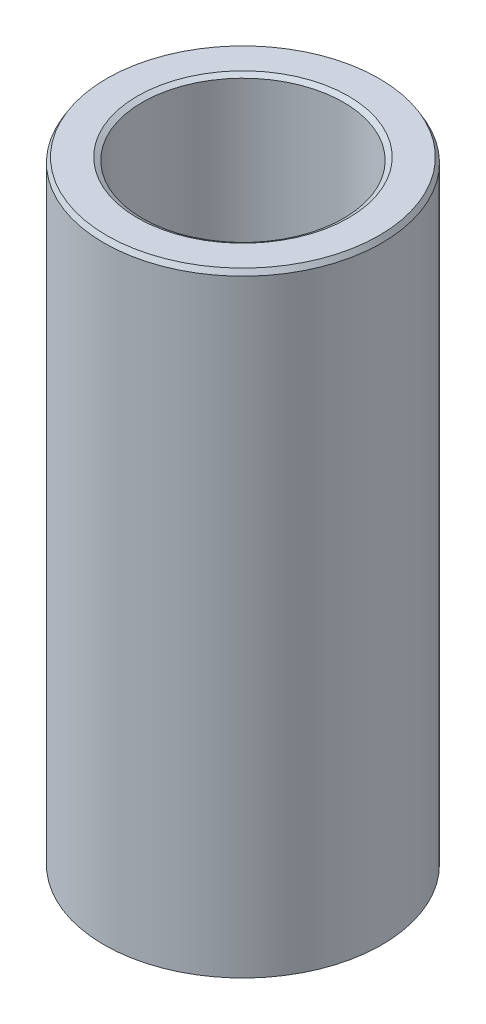
ISO-10303-21;
HEADER;
FILE_DESCRIPTION(('STEP AP214'),'2;1');
FILE_NAME('part.step','',(''),(''),'','','');
FILE_SCHEMA(('AUTOMOTIVE_DESIGN { 1 0 10303 214 1 1 1 1 }'));
ENDSEC;
DATA;
#1=APPLICATION_CONTEXT('core data for automotive mechanical design processes');
#2=APPLICATION_PROTOCOL_DEFINITION('international standard','automotive_design',2000,#1);
#3=PRODUCT_CONTEXT('',#1,'mechanical');
#4=PRODUCT('Part','Part','',(#3));
#5=PRODUCT_RELATED_PRODUCT_CATEGORY('part','',(#4));
#6=PRODUCT_DEFINITION_FORMATION('','',#4);
#7=PRODUCT_DEFINITION_CONTEXT('part definition',#1,'design');
#8=PRODUCT_DEFINITION('design','',#6,#7);
#9=PRODUCT_DEFINITION_SHAPE('','',#8);
#10=(LENGTH_UNIT() NAMED_UNIT(*) SI_UNIT(.MILLI.,.METRE.));
#11=(NAMED_UNIT(*) PLANE_ANGLE_UNIT() SI_UNIT($,.RADIAN.));
#12=(NAMED_UNIT(*) SI_UNIT($,.STERADIAN.) SOLID_ANGLE_UNIT());
#13=UNCERTAINTY_MEASURE_WITH_UNIT(LENGTH_MEASURE(1.E-05),#10,'distance_accuracy_value','');
#14=(GEOMETRIC_REPRESENTATION_CONTEXT(3) GLOBAL_UNCERTAINTY_ASSIGNED_CONTEXT((#13)) GLOBAL_UNIT_ASSIGNED_CONTEXT((#10,
#11,#12)) REPRESENTATION_CONTEXT('',''));
#15=CARTESIAN_POINT('',(0.,0.,0.));
#16=DIRECTION('',(0.,0.,1.));
#17=DIRECTION('',(1.,0.,0.));
#18=AXIS2_PLACEMENT_3D('',#15,#16,#17);
#19=CARTESIAN_POINT('',(0.,121.830156163473,0.));
#20=DIRECTION('',(0.,-1.,0.));
#21=DIRECTION('',(0.,0.,-1.));
#22=AXIS2_PLACEMENT_3D('',#19,#20,#21);
#23=CYLINDRICAL_SURFACE('',#22,27.5);
#24=CARTESIAN_POINT('',(0.,0.568838435717145,0.));
#25=DIRECTION('',(0.,1.,0.));
#26=DIRECTION('',(0.,0.,1.));
#27=AXIS2_PLACEMENT_3D('',#24,#25,#26);
#28=CIRCLE('',#27,27.5);
#29=CARTESIAN_POINT('',(0.,0.568838435717145,27.5));
#30=VERTEX_POINT('',#29);
#31=EDGE_CURVE('E10',#30,#30,#28,.T.);
#32=ORIENTED_EDGE('',*,*,#31,.T.);
#33=EDGE_LOOP('',(#32));
#34=FACE_BOUND('',#33,.T.);
#35=CARTESIAN_POINT('',(0.,120.844899091513,0.));
#36=DIRECTION('',(0.,1.,0.));
#37=DIRECTION('',(0.,0.,1.));
#38=AXIS2_PLACEMENT_3D('',#35,#36,#37);
#39=CIRCLE('',#38,27.5);
#40=CARTESIAN_POINT('',(0.,120.844899091513,27.5));
#41=VERTEX_POINT('',#40);
#42=EDGE_CURVE('E50',#41,#41,#39,.F.);
#43=ORIENTED_EDGE('',*,*,#42,.T.);
#44=EDGE_LOOP('',(#43));
#45=FACE_BOUND('',#44,.T.);
#46=ADVANCED_FACE('F39',(#34,#45),#23,.T.);
#47=CARTESIAN_POINT('',(0.,121.830156163473,0.));
#48=DIRECTION('',(0.,1.,0.));
#49=DIRECTION('',(0.,0.,1.));
#50=AXIS2_PLACEMENT_3D('',#47,#48,#49);
#51=PLANE('',#50);
#52=CARTESIAN_POINT('',(0.,121.830156163473,0.));
#53=DIRECTION('',(0.,1.,0.));
#54=DIRECTION('',(0.,0.,1.));
#55=AXIS2_PLACEMENT_3D('',#52,#53,#54);
#56=CIRCLE('',#55,20.8912469085527);
#57=CARTESIAN_POINT('',(0.,121.830156163473,20.8912469085527));
#58=VERTEX_POINT('',#57);
#59=EDGE_CURVE('E58',#58,#58,#56,.F.);
#60=ORIENTED_EDGE('',*,*,#59,.T.);
#61=EDGE_LOOP('',(#60));
#62=FACE_BOUND('',#61,.T.);
#63=CARTESIAN_POINT('',(0.,121.830156163473,0.));
#64=DIRECTION('',(0.,1.,0.));
#65=DIRECTION('',(0.,0.,1.));
#66=AXIS2_PLACEMENT_3D('',#63,#64,#65);
#67=CIRCLE('',#66,26.9311615642829);
#68=CARTESIAN_POINT('',(0.,121.830156163473,26.9311615642829));
#69=VERTEX_POINT('',#68);
#70=EDGE_CURVE('E61',#69,#69,#67,.T.);
#71=ORIENTED_EDGE('',*,*,#70,.T.);
#72=EDGE_LOOP('',(#71));
#73=FACE_BOUND('',#72,.T.);
#74=ADVANCED_FACE('F88',(#62,#73),#51,.T.);
#75=CARTESIAN_POINT('',(0.,0.,0.));
#76=DIRECTION('',(0.,1.,0.));
#77=DIRECTION('',(0.,0.,1.));
#78=AXIS2_PLACEMENT_3D('',#75,#76,#77);
#79=PLANE('',#78);
#80=CARTESIAN_POINT('',(0.,0.,0.));
#81=DIRECTION('',(0.,1.,0.));
#82=DIRECTION('',(0.,0.,1.));
#83=AXIS2_PLACEMENT_3D('',#80,#81,#82);
#84=CIRCLE('',#83,20.4748282723097);
#85=CARTESIAN_POINT('',(0.,0.,20.4748282723097));
#86=VERTEX_POINT('',#85);
#87=EDGE_CURVE('E51',#86,#86,#84,.T.);
#88=ORIENTED_EDGE('',*,*,#87,.T.);
#89=EDGE_LOOP('',(#88));
#90=FACE_BOUND('',#89,.T.);
#91=CARTESIAN_POINT('',(0.,0.,0.));
#92=DIRECTION('',(0.,1.,0.));
#93=DIRECTION('',(0.,0.,1.));
#94=AXIS2_PLACEMENT_3D('',#91,#92,#93);
#95=CIRCLE('',#94,26.5147429280399);
#96=CARTESIAN_POINT('',(0.,0.,26.5147429280399));
#97=VERTEX_POINT('',#96);
#98=EDGE_CURVE('E54',#97,#97,#95,.F.);
#99=ORIENTED_EDGE('',*,*,#98,.T.);
#100=EDGE_LOOP('',(#99));
#101=FACE_BOUND('',#100,.T.);
#102=ADVANCED_FACE('F83',(#90,#101),#79,.F.);
#103=CARTESIAN_POINT('',(0.,121.830156163473,0.));
#104=DIRECTION('',(0.,-1.,0.));
#105=DIRECTION('',(0.,0.,-1.));
#106=AXIS2_PLACEMENT_3D('',#103,#104,#105);
#107=CYLINDRICAL_SURFACE('',#106,19.9059898365926);
#108=CARTESIAN_POINT('',(0.,121.261317727756,0.));
#109=DIRECTION('',(0.,1.,0.));
#110=DIRECTION('',(0.,0.,1.));
#111=AXIS2_PLACEMENT_3D('',#108,#109,#110);
#112=CIRCLE('',#111,19.9059898365926);
#113=CARTESIAN_POINT('',(0.,121.261317727756,19.9059898365926));
#114=VERTEX_POINT('',#113);
#115=EDGE_CURVE('E67',#114,#114,#112,.T.);
#116=ORIENTED_EDGE('',*,*,#115,.T.);
#117=EDGE_LOOP('',(#116));
#118=FACE_BOUND('',#117,.T.);
#119=CARTESIAN_POINT('',(0.,0.98525707196008,0.));
#120=DIRECTION('',(0.,1.,0.));
#121=DIRECTION('',(0.,0.,1.));
#122=AXIS2_PLACEMENT_3D('',#119,#120,#121);
#123=CIRCLE('',#122,19.9059898365926);
#124=CARTESIAN_POINT('',(0.,0.98525707196008,19.9059898365926));
#125=VERTEX_POINT('',#124);
#126=EDGE_CURVE('E69',#125,#125,#123,.F.);
#127=ORIENTED_EDGE('',*,*,#126,.T.);
#128=EDGE_LOOP('',(#127));
#129=FACE_BOUND('',#128,.T.);
#130=ADVANCED_FACE('F71',(#118,#129),#107,.F.);
#131=CARTESIAN_POINT('',(0.,121.261317727756,0.));
#132=DIRECTION('',(0.,1.,0.));
#133=DIRECTION('',(0.,0.,1.));
#134=AXIS2_PLACEMENT_3D('',#131,#132,#133);
#135=CONICAL_SURFACE('',#134,19.9059898365926,1.0471975511966);
#136=ORIENTED_EDGE('',*,*,#59,.F.);
#137=EDGE_LOOP('',(#136));
#138=FACE_BOUND('',#137,.T.);
#139=ORIENTED_EDGE('',*,*,#115,.F.);
#140=EDGE_LOOP('',(#139));
#141=FACE_BOUND('',#140,.T.);
#142=ADVANCED_FACE('F77',(#138,#141),#135,.F.);
#143=CARTESIAN_POINT('',(0.,0.,0.));
#144=DIRECTION('',(0.,-1.,0.));
#145=DIRECTION('',(0.,0.,-1.));
#146=AXIS2_PLACEMENT_3D('',#143,#144,#145);
#147=CONICAL_SURFACE('',#146,20.4748282723097,0.523598775598288);
#148=ORIENTED_EDGE('',*,*,#126,.F.);
#149=EDGE_LOOP('',(#148));
#150=FACE_BOUND('',#149,.T.);
#151=ORIENTED_EDGE('',*,*,#87,.F.);
#152=EDGE_LOOP('',(#151));
#153=FACE_BOUND('',#152,.T.);
#154=ADVANCED_FACE('F73',(#150,#153),#147,.F.);
#155=CARTESIAN_POINT('',(0.,0.568838435717145,0.));
#156=DIRECTION('',(0.,1.,0.));
#157=DIRECTION('',(0.,0.,1.));
#158=AXIS2_PLACEMENT_3D('',#155,#156,#157);
#159=CONICAL_SURFACE('',#158,27.5,1.04719755119661);
#160=ORIENTED_EDGE('',*,*,#98,.F.);
#161=EDGE_LOOP('',(#160));
#162=FACE_BOUND('',#161,.T.);
#163=ORIENTED_EDGE('',*,*,#31,.F.);
#164=EDGE_LOOP('',(#163));
#165=FACE_BOUND('',#164,.T.);
#166=ADVANCED_FACE('F76',(#162,#165),#159,.T.);
#167=CARTESIAN_POINT('',(0.,121.830156163473,0.));
#168=DIRECTION('',(0.,-1.,0.));
#169=DIRECTION('',(0.,0.,-1.));
#170=AXIS2_PLACEMENT_3D('',#167,#168,#169);
#171=CONICAL_SURFACE('',#170,26.9311615642829,0.523598775598297);
#172=ORIENTED_EDGE('',*,*,#42,.F.);
#173=EDGE_LOOP('',(#172));
#174=FACE_BOUND('',#173,.T.);
#175=ORIENTED_EDGE('',*,*,#70,.F.);
#176=EDGE_LOOP('',(#175));
#177=FACE_BOUND('',#176,.T.);
#178=ADVANCED_FACE('F45',(#174,#177),#171,.T.);
#179=CLOSED_SHELL('',(#46,#74,#102,#130,#142,#154,#166,#178));
#180=MANIFOLD_SOLID_BREP('B2',#179);
#181=ADVANCED_BREP_SHAPE_REPRESENTATION('',(#18,#180),#14);
#182=SHAPE_DEFINITION_REPRESENTATION(#9,#181);
ENDSEC;
END-ISO-10303-21;
